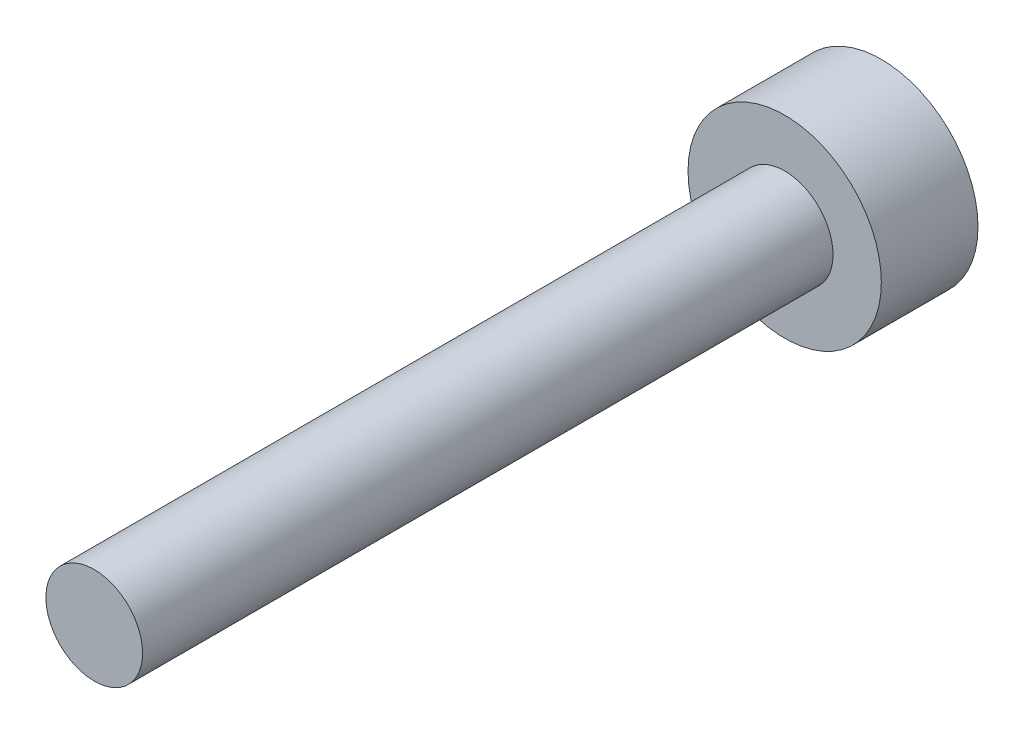
ISO-10303-21;
HEADER;
FILE_DESCRIPTION(('STEP AP214'),'2;1');
FILE_NAME('part.step','',(''),(''),'','','');
FILE_SCHEMA(('AUTOMOTIVE_DESIGN { 1 0 10303 214 1 1 1 1 }'));
ENDSEC;
DATA;
#1=APPLICATION_CONTEXT('core data for automotive mechanical design processes');
#2=APPLICATION_PROTOCOL_DEFINITION('international standard','automotive_design',2000,#1);
#3=PRODUCT_CONTEXT('',#1,'mechanical');
#4=PRODUCT('Part','Part','',(#3));
#5=PRODUCT_RELATED_PRODUCT_CATEGORY('part','',(#4));
#6=PRODUCT_DEFINITION_FORMATION('','',#4);
#7=PRODUCT_DEFINITION_CONTEXT('part definition',#1,'design');
#8=PRODUCT_DEFINITION('design','',#6,#7);
#9=PRODUCT_DEFINITION_SHAPE('','',#8);
#10=(LENGTH_UNIT() NAMED_UNIT(*) SI_UNIT(.MILLI.,.METRE.));
#11=(NAMED_UNIT(*) PLANE_ANGLE_UNIT() SI_UNIT($,.RADIAN.));
#12=(NAMED_UNIT(*) SI_UNIT($,.STERADIAN.) SOLID_ANGLE_UNIT());
#13=UNCERTAINTY_MEASURE_WITH_UNIT(LENGTH_MEASURE(1.E-05),#10,'distance_accuracy_value','');
#14=(GEOMETRIC_REPRESENTATION_CONTEXT(3) GLOBAL_UNCERTAINTY_ASSIGNED_CONTEXT((#13)) GLOBAL_UNIT_ASSIGNED_CONTEXT((#10,
#11,#12)) REPRESENTATION_CONTEXT('',''));
#15=CARTESIAN_POINT('',(0.,0.,0.));
#16=DIRECTION('',(0.,0.,1.));
#17=DIRECTION('',(1.,0.,0.));
#18=AXIS2_PLACEMENT_3D('',#15,#16,#17);
#19=CARTESIAN_POINT('',(0.,0.,1.4));
#20=DIRECTION('',(0.,0.,-1.));
#21=DIRECTION('',(-1.,0.,0.));
#22=AXIS2_PLACEMENT_3D('',#19,#20,#21);
#23=CYLINDRICAL_SURFACE('',#22,1.4);
#24=CARTESIAN_POINT('',(0.,0.,1.4));
#25=DIRECTION('',(0.,0.,1.));
#26=DIRECTION('',(1.,0.,0.));
#27=AXIS2_PLACEMENT_3D('',#24,#25,#26);
#28=CIRCLE('',#27,1.4);
#29=CARTESIAN_POINT('',(1.4,0.,1.4));
#30=VERTEX_POINT('',#29);
#31=EDGE_CURVE('E42',#30,#30,#28,.T.);
#32=ORIENTED_EDGE('',*,*,#31,.F.);
#33=EDGE_LOOP('',(#32));
#34=FACE_BOUND('',#33,.T.);
#35=CARTESIAN_POINT('',(0.,0.,0.));
#36=DIRECTION('',(0.,0.,1.));
#37=DIRECTION('',(1.,0.,0.));
#38=AXIS2_PLACEMENT_3D('',#35,#36,#37);
#39=CIRCLE('',#38,1.4);
#40=CARTESIAN_POINT('',(1.4,0.,0.));
#41=VERTEX_POINT('',#40);
#42=EDGE_CURVE('E37',#41,#41,#39,.T.);
#43=ORIENTED_EDGE('',*,*,#42,.T.);
#44=EDGE_LOOP('',(#43));
#45=FACE_BOUND('',#44,.T.);
#46=ADVANCED_FACE('F34',(#34,#45),#23,.T.);
#47=CARTESIAN_POINT('',(0.,0.,1.4));
#48=DIRECTION('',(0.,0.,1.));
#49=DIRECTION('',(1.,0.,0.));
#50=AXIS2_PLACEMENT_3D('',#47,#48,#49);
#51=PLANE('',#50);
#52=CARTESIAN_POINT('',(0.,0.,1.4));
#53=DIRECTION('',(0.,0.,1.));
#54=DIRECTION('',(1.,0.,0.));
#55=AXIS2_PLACEMENT_3D('',#52,#53,#54);
#56=CIRCLE('',#55,0.7);
#57=CARTESIAN_POINT('',(0.7,0.,1.4));
#58=VERTEX_POINT('',#57);
#59=EDGE_CURVE('E11',#58,#58,#56,.T.);
#60=ORIENTED_EDGE('',*,*,#59,.F.);
#61=EDGE_LOOP('',(#60));
#62=FACE_BOUND('',#61,.T.);
#63=ORIENTED_EDGE('',*,*,#31,.T.);
#64=EDGE_LOOP('',(#63));
#65=FACE_BOUND('',#64,.T.);
#66=ADVANCED_FACE('F154',(#62,#65),#51,.T.);
#67=CARTESIAN_POINT('',(0.,0.,0.));
#68=DIRECTION('',(0.,0.,1.));
#69=DIRECTION('',(1.,0.,0.));
#70=AXIS2_PLACEMENT_3D('',#67,#68,#69);
#71=PLANE('',#70);
#72=DIRECTION('',(0.866025403784438,-0.500000000000001,0.));
#73=VECTOR('',#72,1.);
#74=CARTESIAN_POINT('',(0.,0.68,0.));
#75=LINE('',#74,#73);
#76=CARTESIAN_POINT('',(0.,0.68,0.));
#77=VERTEX_POINT('',#76);
#78=CARTESIAN_POINT('',(0.588897274573419,0.339999999999999,0.));
#79=VERTEX_POINT('',#78);
#80=EDGE_CURVE('E124',#77,#79,#75,.T.);
#81=ORIENTED_EDGE('',*,*,#80,.F.);
#82=DIRECTION('',(0.866025403784442,0.499999999999995,0.));
#83=VECTOR('',#82,1.);
#84=CARTESIAN_POINT('',(-0.588897274573414,0.340000000000007,0.));
#85=LINE('',#84,#83);
#86=CARTESIAN_POINT('',(-0.588897274573414,0.340000000000007,0.));
#87=VERTEX_POINT('',#86);
#88=EDGE_CURVE('E50',#87,#77,#85,.T.);
#89=ORIENTED_EDGE('',*,*,#88,.F.);
#90=DIRECTION('',(0.,1.,0.));
#91=VECTOR('',#90,1.);
#92=CARTESIAN_POINT('',(-0.588897274573421,-0.339999999999995,0.));
#93=LINE('',#92,#91);
#94=CARTESIAN_POINT('',(-0.588897274573421,-0.339999999999995,0.));
#95=VERTEX_POINT('',#94);
#96=EDGE_CURVE('E133',#95,#87,#93,.T.);
#97=ORIENTED_EDGE('',*,*,#96,.F.);
#98=DIRECTION('',(-0.866025403784435,0.500000000000007,0.));
#99=VECTOR('',#98,1.);
#100=CARTESIAN_POINT('',(0.,-0.68,0.));
#101=LINE('',#100,#99);
#102=CARTESIAN_POINT('',(0.,-0.68,0.));
#103=VERTEX_POINT('',#102);
#104=EDGE_CURVE('E131',#103,#95,#101,.T.);
#105=ORIENTED_EDGE('',*,*,#104,.F.);
#106=DIRECTION('',(-0.866025403784441,-0.499999999999995,0.));
#107=VECTOR('',#106,1.);
#108=CARTESIAN_POINT('',(0.588897274573417,-0.340000000000003,0.));
#109=LINE('',#108,#107);
#110=CARTESIAN_POINT('',(0.588897274573417,-0.340000000000003,0.));
#111=VERTEX_POINT('',#110);
#112=EDGE_CURVE('E98',#111,#103,#109,.T.);
#113=ORIENTED_EDGE('',*,*,#112,.F.);
#114=DIRECTION('',(0.,-1.,0.));
#115=VECTOR('',#114,1.);
#116=CARTESIAN_POINT('',(0.588897274573419,0.339999999999999,0.));
#117=LINE('',#116,#115);
#118=EDGE_CURVE('E127',#79,#111,#117,.T.);
#119=ORIENTED_EDGE('',*,*,#118,.F.);
#120=EDGE_LOOP('',(#81,#89,#97,#105,#113,#119));
#121=FACE_BOUND('',#120,.T.);
#122=ORIENTED_EDGE('',*,*,#42,.F.);
#123=EDGE_LOOP('',(#122));
#124=FACE_BOUND('',#123,.T.);
#125=ADVANCED_FACE('F151',(#121,#124),#71,.F.);
#126=CARTESIAN_POINT('',(0.,0.,11.4));
#127=DIRECTION('',(0.,0.,-1.));
#128=DIRECTION('',(-1.,0.,0.));
#129=AXIS2_PLACEMENT_3D('',#126,#127,#128);
#130=CYLINDRICAL_SURFACE('',#129,0.7);
#131=CARTESIAN_POINT('',(0.,0.,11.4));
#132=DIRECTION('',(0.,0.,1.));
#133=DIRECTION('',(1.,0.,0.));
#134=AXIS2_PLACEMENT_3D('',#131,#132,#133);
#135=CIRCLE('',#134,0.7);
#136=CARTESIAN_POINT('',(0.7,0.,11.4));
#137=VERTEX_POINT('',#136);
#138=EDGE_CURVE('E137',#137,#137,#135,.T.);
#139=ORIENTED_EDGE('',*,*,#138,.F.);
#140=EDGE_LOOP('',(#139));
#141=FACE_BOUND('',#140,.T.);
#142=ORIENTED_EDGE('',*,*,#59,.T.);
#143=EDGE_LOOP('',(#142));
#144=FACE_BOUND('',#143,.T.);
#145=ADVANCED_FACE('F153',(#141,#144),#130,.T.);
#146=CARTESIAN_POINT('',(0.,0.,11.4));
#147=DIRECTION('',(0.,0.,1.));
#148=DIRECTION('',(1.,0.,0.));
#149=AXIS2_PLACEMENT_3D('',#146,#147,#148);
#150=PLANE('',#149);
#151=ORIENTED_EDGE('',*,*,#138,.T.);
#152=EDGE_LOOP('',(#151));
#153=FACE_BOUND('',#152,.T.);
#154=ADVANCED_FACE('F160',(#153),#150,.T.);
#155=CARTESIAN_POINT('',(-0.588897274573414,0.340000000000007,1.));
#156=DIRECTION('',(-0.499999999999995,0.866025403784442,0.));
#157=DIRECTION('',(-0.866025403784442,-0.499999999999995,0.));
#158=AXIS2_PLACEMENT_3D('',#155,#156,#157);
#159=PLANE('',#158);
#160=ORIENTED_EDGE('',*,*,#88,.T.);
#161=DIRECTION('',(0.,0.,-1.));
#162=VECTOR('',#161,1.);
#163=CARTESIAN_POINT('',(0.,0.68,1.));
#164=LINE('',#163,#162);
#165=CARTESIAN_POINT('',(0.,0.68,1.));
#166=VERTEX_POINT('',#165);
#167=EDGE_CURVE('E80',#166,#77,#164,.T.);
#168=ORIENTED_EDGE('',*,*,#167,.F.);
#169=DIRECTION('',(0.866025403784442,0.499999999999995,0.));
#170=VECTOR('',#169,1.);
#171=CARTESIAN_POINT('',(-0.588897274573414,0.340000000000007,1.));
#172=LINE('',#171,#170);
#173=CARTESIAN_POINT('',(-0.588897274573414,0.340000000000007,1.));
#174=VERTEX_POINT('',#173);
#175=EDGE_CURVE('E135',#174,#166,#172,.T.);
#176=ORIENTED_EDGE('',*,*,#175,.F.);
#177=DIRECTION('',(0.,0.,-1.));
#178=VECTOR('',#177,1.);
#179=CARTESIAN_POINT('',(-0.588897274573414,0.340000000000007,1.));
#180=LINE('',#179,#178);
#181=EDGE_CURVE('E58',#174,#87,#180,.T.);
#182=ORIENTED_EDGE('',*,*,#181,.T.);
#183=EDGE_LOOP('',(#160,#168,#176,#182));
#184=FACE_BOUND('',#183,.T.);
#185=ADVANCED_FACE('F189',(#184),#159,.F.);
#186=CARTESIAN_POINT('',(-0.588897274573421,-0.339999999999995,1.));
#187=DIRECTION('',(-1.,0.,0.));
#188=DIRECTION('',(0.,-1.,0.));
#189=AXIS2_PLACEMENT_3D('',#186,#187,#188);
#190=PLANE('',#189);
#191=ORIENTED_EDGE('',*,*,#96,.T.);
#192=ORIENTED_EDGE('',*,*,#181,.F.);
#193=DIRECTION('',(0.,1.,0.));
#194=VECTOR('',#193,1.);
#195=CARTESIAN_POINT('',(-0.588897274573421,-0.339999999999995,1.));
#196=LINE('',#195,#194);
#197=CARTESIAN_POINT('',(-0.588897274573421,-0.339999999999995,1.));
#198=VERTEX_POINT('',#197);
#199=EDGE_CURVE('E110',#198,#174,#196,.T.);
#200=ORIENTED_EDGE('',*,*,#199,.F.);
#201=DIRECTION('',(0.,0.,-1.));
#202=VECTOR('',#201,1.);
#203=CARTESIAN_POINT('',(-0.588897274573421,-0.339999999999995,1.));
#204=LINE('',#203,#202);
#205=EDGE_CURVE('E102',#198,#95,#204,.T.);
#206=ORIENTED_EDGE('',*,*,#205,.T.);
#207=EDGE_LOOP('',(#191,#192,#200,#206));
#208=FACE_BOUND('',#207,.T.);
#209=ADVANCED_FACE('F203',(#208),#190,.F.);
#210=CARTESIAN_POINT('',(0.,-0.68,1.));
#211=DIRECTION('',(-0.500000000000007,-0.866025403784435,0.));
#212=DIRECTION('',(0.866025403784435,-0.500000000000007,0.));
#213=AXIS2_PLACEMENT_3D('',#210,#211,#212);
#214=PLANE('',#213);
#215=ORIENTED_EDGE('',*,*,#104,.T.);
#216=ORIENTED_EDGE('',*,*,#205,.F.);
#217=DIRECTION('',(-0.866025403784435,0.500000000000007,0.));
#218=VECTOR('',#217,1.);
#219=CARTESIAN_POINT('',(0.,-0.68,1.));
#220=LINE('',#219,#218);
#221=CARTESIAN_POINT('',(0.,-0.68,1.));
#222=VERTEX_POINT('',#221);
#223=EDGE_CURVE('E106',#222,#198,#220,.T.);
#224=ORIENTED_EDGE('',*,*,#223,.F.);
#225=DIRECTION('',(0.,0.,-1.));
#226=VECTOR('',#225,1.);
#227=CARTESIAN_POINT('',(0.,-0.68,1.));
#228=LINE('',#227,#226);
#229=EDGE_CURVE('E91',#222,#103,#228,.T.);
#230=ORIENTED_EDGE('',*,*,#229,.T.);
#231=EDGE_LOOP('',(#215,#216,#224,#230));
#232=FACE_BOUND('',#231,.T.);
#233=ADVANCED_FACE('F107',(#232),#214,.F.);
#234=CARTESIAN_POINT('',(0.588897274573417,-0.340000000000003,1.));
#235=DIRECTION('',(0.499999999999995,-0.866025403784441,0.));
#236=DIRECTION('',(0.866025403784442,0.499999999999995,0.));
#237=AXIS2_PLACEMENT_3D('',#234,#235,#236);
#238=PLANE('',#237);
#239=ORIENTED_EDGE('',*,*,#112,.T.);
#240=ORIENTED_EDGE('',*,*,#229,.F.);
#241=DIRECTION('',(-0.866025403784441,-0.499999999999995,0.));
#242=VECTOR('',#241,1.);
#243=CARTESIAN_POINT('',(0.588897274573417,-0.340000000000003,1.));
#244=LINE('',#243,#242);
#245=CARTESIAN_POINT('',(0.588897274573417,-0.340000000000003,1.));
#246=VERTEX_POINT('',#245);
#247=EDGE_CURVE('E95',#246,#222,#244,.T.);
#248=ORIENTED_EDGE('',*,*,#247,.F.);
#249=DIRECTION('',(0.,0.,-1.));
#250=VECTOR('',#249,1.);
#251=CARTESIAN_POINT('',(0.588897274573417,-0.340000000000003,1.));
#252=LINE('',#251,#250);
#253=EDGE_CURVE('E103',#246,#111,#252,.T.);
#254=ORIENTED_EDGE('',*,*,#253,.T.);
#255=EDGE_LOOP('',(#239,#240,#248,#254));
#256=FACE_BOUND('',#255,.T.);
#257=ADVANCED_FACE('F93',(#256),#238,.F.);
#258=CARTESIAN_POINT('',(0.588897274573419,0.339999999999999,1.));
#259=DIRECTION('',(1.,0.,0.));
#260=DIRECTION('',(0.,1.,0.));
#261=AXIS2_PLACEMENT_3D('',#258,#259,#260);
#262=PLANE('',#261);
#263=ORIENTED_EDGE('',*,*,#118,.T.);
#264=ORIENTED_EDGE('',*,*,#253,.F.);
#265=DIRECTION('',(0.,-1.,0.));
#266=VECTOR('',#265,1.);
#267=CARTESIAN_POINT('',(0.588897274573419,0.339999999999999,1.));
#268=LINE('',#267,#266);
#269=CARTESIAN_POINT('',(0.588897274573419,0.339999999999999,1.));
#270=VERTEX_POINT('',#269);
#271=EDGE_CURVE('E116',#270,#246,#268,.T.);
#272=ORIENTED_EDGE('',*,*,#271,.F.);
#273=DIRECTION('',(0.,0.,-1.));
#274=VECTOR('',#273,1.);
#275=CARTESIAN_POINT('',(0.588897274573419,0.339999999999999,1.));
#276=LINE('',#275,#274);
#277=EDGE_CURVE('E140',#270,#79,#276,.T.);
#278=ORIENTED_EDGE('',*,*,#277,.T.);
#279=EDGE_LOOP('',(#263,#264,#272,#278));
#280=FACE_BOUND('',#279,.T.);
#281=ADVANCED_FACE('F228',(#280),#262,.F.);
#282=CARTESIAN_POINT('',(0.,0.68,1.));
#283=DIRECTION('',(0.500000000000001,0.866025403784438,0.));
#284=DIRECTION('',(-0.866025403784438,0.500000000000001,0.));
#285=AXIS2_PLACEMENT_3D('',#282,#283,#284);
#286=PLANE('',#285);
#287=ORIENTED_EDGE('',*,*,#80,.T.);
#288=ORIENTED_EDGE('',*,*,#277,.F.);
#289=DIRECTION('',(0.866025403784438,-0.500000000000001,0.));
#290=VECTOR('',#289,1.);
#291=CARTESIAN_POINT('',(0.,0.68,1.));
#292=LINE('',#291,#290);
#293=EDGE_CURVE('E118',#166,#270,#292,.T.);
#294=ORIENTED_EDGE('',*,*,#293,.F.);
#295=ORIENTED_EDGE('',*,*,#167,.T.);
#296=EDGE_LOOP('',(#287,#288,#294,#295));
#297=FACE_BOUND('',#296,.T.);
#298=ADVANCED_FACE('F237',(#297),#286,.F.);
#299=CARTESIAN_POINT('',(0.,0.,1.));
#300=DIRECTION('',(0.,0.,-1.));
#301=DIRECTION('',(-1.,0.,0.));
#302=AXIS2_PLACEMENT_3D('',#299,#300,#301);
#303=PLANE('',#302);
#304=ORIENTED_EDGE('',*,*,#175,.T.);
#305=ORIENTED_EDGE('',*,*,#293,.T.);
#306=ORIENTED_EDGE('',*,*,#271,.T.);
#307=ORIENTED_EDGE('',*,*,#247,.T.);
#308=ORIENTED_EDGE('',*,*,#223,.T.);
#309=ORIENTED_EDGE('',*,*,#199,.T.);
#310=EDGE_LOOP('',(#304,#305,#306,#307,#308,#309));
#311=FACE_BOUND('',#310,.T.);
#312=ADVANCED_FACE('F113',(#311),#303,.T.);
#313=CLOSED_SHELL('',(#46,#66,#125,#145,#154,#185,#209,#233,#257,#281,#298,#312));
#314=MANIFOLD_SOLID_BREP('B2',#313);
#315=ADVANCED_BREP_SHAPE_REPRESENTATION('',(#18,#314),#14);
#316=SHAPE_DEFINITION_REPRESENTATION(#9,#315);
ENDSEC;
END-ISO-10303-21;
